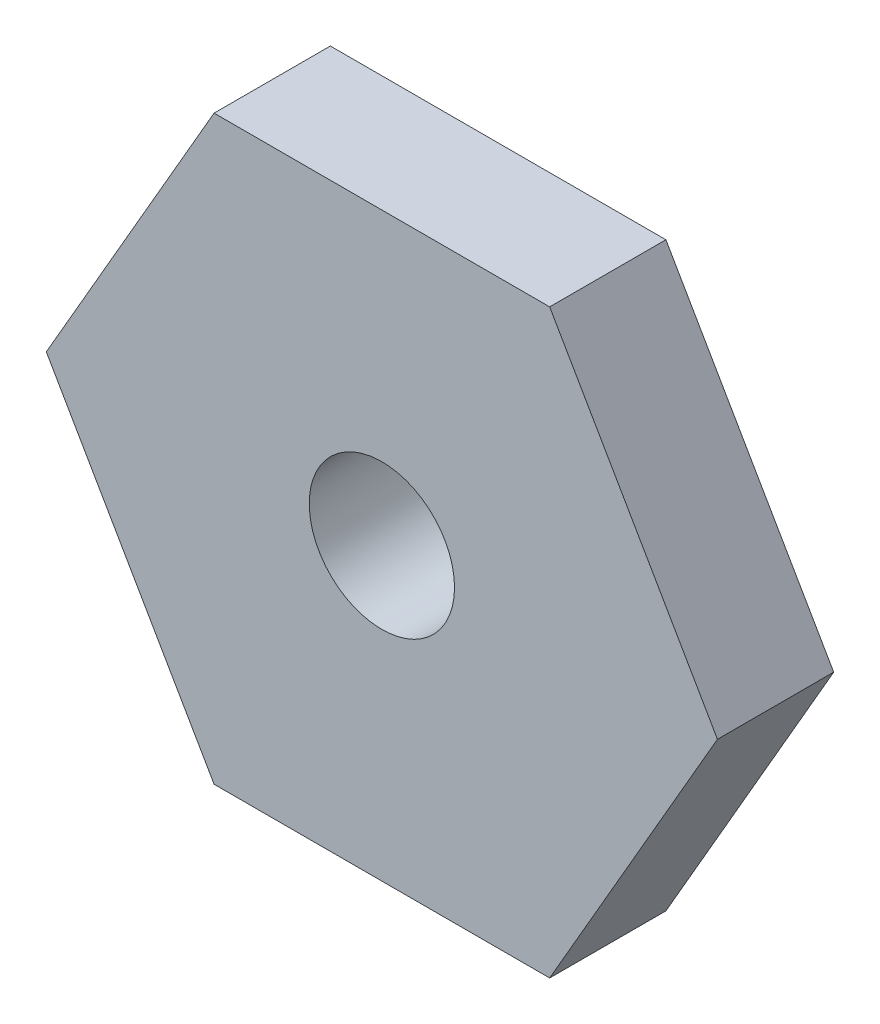
ISO-10303-21;
HEADER;
FILE_DESCRIPTION(('STEP AP214'),'2;1');
FILE_NAME('part.step','',(''),(''),'','','');
FILE_SCHEMA(('AUTOMOTIVE_DESIGN { 1 0 10303 214 1 1 1 1 }'));
ENDSEC;
DATA;
#1=APPLICATION_CONTEXT('core data for automotive mechanical design processes');
#2=APPLICATION_PROTOCOL_DEFINITION('international standard','automotive_design',2000,#1);
#3=PRODUCT_CONTEXT('',#1,'mechanical');
#4=PRODUCT('Part','Part','',(#3));
#5=PRODUCT_RELATED_PRODUCT_CATEGORY('part','',(#4));
#6=PRODUCT_DEFINITION_FORMATION('','',#4);
#7=PRODUCT_DEFINITION_CONTEXT('part definition',#1,'design');
#8=PRODUCT_DEFINITION('design','',#6,#7);
#9=PRODUCT_DEFINITION_SHAPE('','',#8);
#10=(LENGTH_UNIT() NAMED_UNIT(*) SI_UNIT(.MILLI.,.METRE.));
#11=(NAMED_UNIT(*) PLANE_ANGLE_UNIT() SI_UNIT($,.RADIAN.));
#12=(NAMED_UNIT(*) SI_UNIT($,.STERADIAN.) SOLID_ANGLE_UNIT());
#13=UNCERTAINTY_MEASURE_WITH_UNIT(LENGTH_MEASURE(1.E-05),#10,'distance_accuracy_value','');
#14=(GEOMETRIC_REPRESENTATION_CONTEXT(3) GLOBAL_UNCERTAINTY_ASSIGNED_CONTEXT((#13)) GLOBAL_UNIT_ASSIGNED_CONTEXT((#10,
#11,#12)) REPRESENTATION_CONTEXT('',''));
#15=CARTESIAN_POINT('',(0.,0.,0.));
#16=DIRECTION('',(0.,0.,1.));
#17=DIRECTION('',(1.,0.,0.));
#18=AXIS2_PLACEMENT_3D('',#15,#16,#17);
#19=CARTESIAN_POINT('',(11.5470053837924,8.88178419700125E-13,-3.99999999999996));
#20=DIRECTION('',(0.866025403784441,0.500000000000002,0.));
#21=DIRECTION('',(-0.500000000000002,0.866025403784441,0.));
#22=AXIS2_PLACEMENT_3D('',#19,#20,#21);
#23=PLANE('',#22);
#24=DIRECTION('',(-0.500000000000002,0.866025403784441,0.));
#25=VECTOR('',#24,1.);
#26=CARTESIAN_POINT('',(11.5470053837926,-4.44089209850063E-13,0.));
#27=LINE('',#26,#25);
#28=CARTESIAN_POINT('',(11.5470053837926,-4.44089209850063E-13,0.));
#29=VERTEX_POINT('',#28);
#30=CARTESIAN_POINT('',(5.77350269189625,10.0000000000002,0.));
#31=VERTEX_POINT('',#30);
#32=EDGE_CURVE('E134',#29,#31,#27,.T.);
#33=ORIENTED_EDGE('',*,*,#32,.F.);
#34=DIRECTION('',(0.,0.,1.));
#35=VECTOR('',#34,1.);
#36=CARTESIAN_POINT('',(11.5470053837924,8.88178419700125E-13,-3.99999999999996));
#37=LINE('',#36,#35);
#38=CARTESIAN_POINT('',(11.5470053837924,8.88178419700125E-13,-3.99999999999996));
#39=VERTEX_POINT('',#38);
#40=EDGE_CURVE('E11',#39,#29,#37,.T.);
#41=ORIENTED_EDGE('',*,*,#40,.F.);
#42=DIRECTION('',(-0.500000000000002,0.866025403784441,0.));
#43=VECTOR('',#42,1.);
#44=CARTESIAN_POINT('',(11.5470053837924,8.88178419700125E-13,-3.99999999999996));
#45=LINE('',#44,#43);
#46=CARTESIAN_POINT('',(5.77350269189619,10.0000000000002,-4.00000000000003));
#47=VERTEX_POINT('',#46);
#48=EDGE_CURVE('E155',#39,#47,#45,.T.);
#49=ORIENTED_EDGE('',*,*,#48,.T.);
#50=DIRECTION('',(0.,0.,1.));
#51=VECTOR('',#50,1.);
#52=CARTESIAN_POINT('',(5.77350269189619,10.0000000000002,-4.00000000000003));
#53=LINE('',#52,#51);
#54=EDGE_CURVE('E45',#47,#31,#53,.T.);
#55=ORIENTED_EDGE('',*,*,#54,.T.);
#56=EDGE_LOOP('',(#33,#41,#49,#55));
#57=FACE_BOUND('',#56,.T.);
#58=ADVANCED_FACE('F42',(#57),#23,.T.);
#59=CARTESIAN_POINT('',(5.77350269189619,-9.99999999999979,-4.00000000000006));
#60=DIRECTION('',(0.866025403784441,-0.500000000000001,0.));
#61=DIRECTION('',(0.500000000000001,0.866025403784441,0.));
#62=AXIS2_PLACEMENT_3D('',#59,#60,#61);
#63=PLANE('',#62);
#64=DIRECTION('',(0.500000000000001,0.866025403784441,0.));
#65=VECTOR('',#64,1.);
#66=CARTESIAN_POINT('',(5.7735026918963,-9.99999999999979,0.));
#67=LINE('',#66,#65);
#68=CARTESIAN_POINT('',(5.7735026918963,-9.99999999999979,0.));
#69=VERTEX_POINT('',#68);
#70=EDGE_CURVE('E152',#69,#29,#67,.T.);
#71=ORIENTED_EDGE('',*,*,#70,.F.);
#72=DIRECTION('',(0.,0.,1.));
#73=VECTOR('',#72,1.);
#74=CARTESIAN_POINT('',(5.77350269189619,-9.99999999999979,-4.00000000000006));
#75=LINE('',#74,#73);
#76=CARTESIAN_POINT('',(5.77350269189619,-9.99999999999979,-4.00000000000006));
#77=VERTEX_POINT('',#76);
#78=EDGE_CURVE('E52',#77,#69,#75,.T.);
#79=ORIENTED_EDGE('',*,*,#78,.F.);
#80=DIRECTION('',(0.500000000000001,0.866025403784441,0.));
#81=VECTOR('',#80,1.);
#82=CARTESIAN_POINT('',(5.77350269189619,-9.99999999999979,-4.00000000000006));
#83=LINE('',#82,#81);
#84=EDGE_CURVE('E119',#77,#39,#83,.T.);
#85=ORIENTED_EDGE('',*,*,#84,.T.);
#86=ORIENTED_EDGE('',*,*,#40,.T.);
#87=EDGE_LOOP('',(#71,#79,#85,#86));
#88=FACE_BOUND('',#87,.T.);
#89=ADVANCED_FACE('F170',(#88),#63,.T.);
#90=CARTESIAN_POINT('',(-5.77350269189641,-10.0000000000007,-4.));
#91=DIRECTION('',(0.,-1.,0.));
#92=DIRECTION('',(1.,0.,0.));
#93=AXIS2_PLACEMENT_3D('',#90,#91,#92);
#94=PLANE('',#93);
#95=DIRECTION('',(1.,0.,0.));
#96=VECTOR('',#95,1.);
#97=CARTESIAN_POINT('',(-5.77350269189619,-10.0000000000007,0.));
#98=LINE('',#97,#96);
#99=CARTESIAN_POINT('',(-5.77350269189619,-10.0000000000007,0.));
#100=VERTEX_POINT('',#99);
#101=EDGE_CURVE('E105',#100,#69,#98,.T.);
#102=ORIENTED_EDGE('',*,*,#101,.F.);
#103=DIRECTION('',(0.,0.,1.));
#104=VECTOR('',#103,1.);
#105=CARTESIAN_POINT('',(-5.77350269189641,-10.0000000000007,-4.));
#106=LINE('',#105,#104);
#107=CARTESIAN_POINT('',(-5.77350269189641,-10.0000000000007,-4.));
#108=VERTEX_POINT('',#107);
#109=EDGE_CURVE('E100',#108,#100,#106,.T.);
#110=ORIENTED_EDGE('',*,*,#109,.F.);
#111=DIRECTION('',(1.,0.,0.));
#112=VECTOR('',#111,1.);
#113=CARTESIAN_POINT('',(-5.77350269189641,-10.0000000000007,-4.));
#114=LINE('',#113,#112);
#115=EDGE_CURVE('E103',#108,#77,#114,.T.);
#116=ORIENTED_EDGE('',*,*,#115,.T.);
#117=ORIENTED_EDGE('',*,*,#78,.T.);
#118=EDGE_LOOP('',(#102,#110,#116,#117));
#119=FACE_BOUND('',#118,.T.);
#120=ADVANCED_FACE('F102',(#119),#94,.T.);
#121=CARTESIAN_POINT('',(-11.5470053837927,8.88178419700125E-13,-4.));
#122=DIRECTION('',(-0.866025403784441,-0.500000000000002,0.));
#123=DIRECTION('',(0.500000000000002,-0.866025403784441,0.));
#124=AXIS2_PLACEMENT_3D('',#121,#122,#123);
#125=PLANE('',#124);
#126=DIRECTION('',(0.500000000000002,-0.866025403784441,0.));
#127=VECTOR('',#126,1.);
#128=CARTESIAN_POINT('',(-11.5470053837926,4.44089209850063E-13,0.));
#129=LINE('',#128,#127);
#130=CARTESIAN_POINT('',(-11.5470053837926,4.44089209850063E-13,0.));
#131=VERTEX_POINT('',#130);
#132=EDGE_CURVE('E147',#131,#100,#129,.T.);
#133=ORIENTED_EDGE('',*,*,#132,.F.);
#134=DIRECTION('',(0.,0.,1.));
#135=VECTOR('',#134,1.);
#136=CARTESIAN_POINT('',(-11.5470053837927,8.88178419700125E-13,-4.));
#137=LINE('',#136,#135);
#138=CARTESIAN_POINT('',(-11.5470053837927,8.88178419700125E-13,-4.));
#139=VERTEX_POINT('',#138);
#140=EDGE_CURVE('E111',#139,#131,#137,.T.);
#141=ORIENTED_EDGE('',*,*,#140,.F.);
#142=DIRECTION('',(0.500000000000002,-0.866025403784441,0.));
#143=VECTOR('',#142,1.);
#144=CARTESIAN_POINT('',(-11.5470053837927,8.88178419700125E-13,-4.));
#145=LINE('',#144,#143);
#146=EDGE_CURVE('E117',#139,#108,#145,.T.);
#147=ORIENTED_EDGE('',*,*,#146,.T.);
#148=ORIENTED_EDGE('',*,*,#109,.T.);
#149=EDGE_LOOP('',(#133,#141,#147,#148));
#150=FACE_BOUND('',#149,.T.);
#151=ADVANCED_FACE('F122',(#150),#125,.T.);
#152=CARTESIAN_POINT('',(-5.77350269189641,9.99999999999934,-3.99999999999996));
#153=DIRECTION('',(-0.866025403784441,0.500000000000001,0.));
#154=DIRECTION('',(-0.500000000000001,-0.866025403784441,0.));
#155=AXIS2_PLACEMENT_3D('',#152,#153,#154);
#156=PLANE('',#155);
#157=DIRECTION('',(-0.500000000000001,-0.866025403784441,0.));
#158=VECTOR('',#157,1.);
#159=CARTESIAN_POINT('',(-5.77350269189625,9.99999999999934,0.));
#160=LINE('',#159,#158);
#161=CARTESIAN_POINT('',(-5.77350269189625,9.99999999999934,0.));
#162=VERTEX_POINT('',#161);
#163=EDGE_CURVE('E143',#162,#131,#160,.T.);
#164=ORIENTED_EDGE('',*,*,#163,.F.);
#165=DIRECTION('',(0.,0.,1.));
#166=VECTOR('',#165,1.);
#167=CARTESIAN_POINT('',(-5.77350269189641,9.99999999999934,-3.99999999999996));
#168=LINE('',#167,#166);
#169=CARTESIAN_POINT('',(-5.77350269189641,9.99999999999934,-3.99999999999996));
#170=VERTEX_POINT('',#169);
#171=EDGE_CURVE('E160',#170,#162,#168,.T.);
#172=ORIENTED_EDGE('',*,*,#171,.F.);
#173=DIRECTION('',(-0.500000000000001,-0.866025403784441,0.));
#174=VECTOR('',#173,1.);
#175=CARTESIAN_POINT('',(-5.77350269189641,9.99999999999934,-3.99999999999996));
#176=LINE('',#175,#174);
#177=EDGE_CURVE('E124',#170,#139,#176,.T.);
#178=ORIENTED_EDGE('',*,*,#177,.T.);
#179=ORIENTED_EDGE('',*,*,#140,.T.);
#180=EDGE_LOOP('',(#164,#172,#178,#179));
#181=FACE_BOUND('',#180,.T.);
#182=ADVANCED_FACE('F183',(#181),#156,.T.);
#183=CARTESIAN_POINT('',(5.77350269189619,10.0000000000002,-4.00000000000003));
#184=DIRECTION('',(0.,1.,0.));
#185=DIRECTION('',(-1.,0.,0.));
#186=AXIS2_PLACEMENT_3D('',#183,#184,#185);
#187=PLANE('',#186);
#188=DIRECTION('',(-1.,0.,0.));
#189=VECTOR('',#188,1.);
#190=CARTESIAN_POINT('',(5.77350269189625,10.0000000000002,0.));
#191=LINE('',#190,#189);
#192=EDGE_CURVE('E138',#31,#162,#191,.T.);
#193=ORIENTED_EDGE('',*,*,#192,.F.);
#194=ORIENTED_EDGE('',*,*,#54,.F.);
#195=DIRECTION('',(-1.,0.,0.));
#196=VECTOR('',#195,1.);
#197=CARTESIAN_POINT('',(5.77350269189619,10.0000000000002,-4.00000000000003));
#198=LINE('',#197,#196);
#199=EDGE_CURVE('E128',#47,#170,#198,.T.);
#200=ORIENTED_EDGE('',*,*,#199,.T.);
#201=ORIENTED_EDGE('',*,*,#171,.T.);
#202=EDGE_LOOP('',(#193,#194,#200,#201));
#203=FACE_BOUND('',#202,.T.);
#204=ADVANCED_FACE('F167',(#203),#187,.T.);
#205=CARTESIAN_POINT('',(-1.66533453693773E-13,0.,-4.));
#206=DIRECTION('',(0.,0.,1.));
#207=DIRECTION('',(1.,0.,0.));
#208=AXIS2_PLACEMENT_3D('',#205,#206,#207);
#209=PLANE('',#208);
#210=CARTESIAN_POINT('',(-1.66533453693773E-13,0.,-4.));
#211=DIRECTION('',(0.,0.,1.));
#212=DIRECTION('',(1.,0.,0.));
#213=AXIS2_PLACEMENT_3D('',#210,#211,#212);
#214=CIRCLE('',#213,2.5);
#215=CARTESIAN_POINT('',(2.49999999999984,0.,-4.00000000000001));
#216=VERTEX_POINT('',#215);
#217=EDGE_CURVE('E139',#216,#216,#214,.T.);
#218=ORIENTED_EDGE('',*,*,#217,.T.);
#219=EDGE_LOOP('',(#218));
#220=FACE_BOUND('',#219,.T.);
#221=ORIENTED_EDGE('',*,*,#48,.F.);
#222=ORIENTED_EDGE('',*,*,#84,.F.);
#223=ORIENTED_EDGE('',*,*,#115,.F.);
#224=ORIENTED_EDGE('',*,*,#146,.F.);
#225=ORIENTED_EDGE('',*,*,#177,.F.);
#226=ORIENTED_EDGE('',*,*,#199,.F.);
#227=EDGE_LOOP('',(#221,#222,#223,#224,#225,#226));
#228=FACE_BOUND('',#227,.T.);
#229=ADVANCED_FACE('F115',(#220,#228),#209,.F.);
#230=CARTESIAN_POINT('',(0.,0.,0.));
#231=DIRECTION('',(0.,0.,1.));
#232=DIRECTION('',(1.,0.,0.));
#233=AXIS2_PLACEMENT_3D('',#230,#231,#232);
#234=PLANE('',#233);
#235=CARTESIAN_POINT('',(0.,0.,0.));
#236=DIRECTION('',(0.,0.,1.));
#237=DIRECTION('',(1.,0.,0.));
#238=AXIS2_PLACEMENT_3D('',#235,#236,#237);
#239=CIRCLE('',#238,2.5);
#240=CARTESIAN_POINT('',(2.50000000000001,0.,0.));
#241=VERTEX_POINT('',#240);
#242=EDGE_CURVE('E206',#241,#241,#239,.T.);
#243=ORIENTED_EDGE('',*,*,#242,.F.);
#244=EDGE_LOOP('',(#243));
#245=FACE_BOUND('',#244,.T.);
#246=ORIENTED_EDGE('',*,*,#32,.T.);
#247=ORIENTED_EDGE('',*,*,#192,.T.);
#248=ORIENTED_EDGE('',*,*,#163,.T.);
#249=ORIENTED_EDGE('',*,*,#132,.T.);
#250=ORIENTED_EDGE('',*,*,#101,.T.);
#251=ORIENTED_EDGE('',*,*,#70,.T.);
#252=EDGE_LOOP('',(#246,#247,#248,#249,#250,#251));
#253=FACE_BOUND('',#252,.T.);
#254=ADVANCED_FACE('F169',(#245,#253),#234,.T.);
#255=CARTESIAN_POINT('',(-1.66533453693773E-13,0.,-4.));
#256=DIRECTION('',(0.,0.,1.));
#257=DIRECTION('',(1.,0.,0.));
#258=AXIS2_PLACEMENT_3D('',#255,#256,#257);
#259=CYLINDRICAL_SURFACE('',#258,2.5);
#260=ORIENTED_EDGE('',*,*,#217,.F.);
#261=EDGE_LOOP('',(#260));
#262=FACE_BOUND('',#261,.T.);
#263=ORIENTED_EDGE('',*,*,#242,.T.);
#264=EDGE_LOOP('',(#263));
#265=FACE_BOUND('',#264,.T.);
#266=ADVANCED_FACE('F194',(#262,#265),#259,.F.);
#267=CLOSED_SHELL('',(#58,#89,#120,#151,#182,#204,#229,#254,#266));
#268=MANIFOLD_SOLID_BREP('B2',#267);
#269=ADVANCED_BREP_SHAPE_REPRESENTATION('',(#18,#268),#14);
#270=SHAPE_DEFINITION_REPRESENTATION(#9,#269);
ENDSEC;
END-ISO-10303-21;
